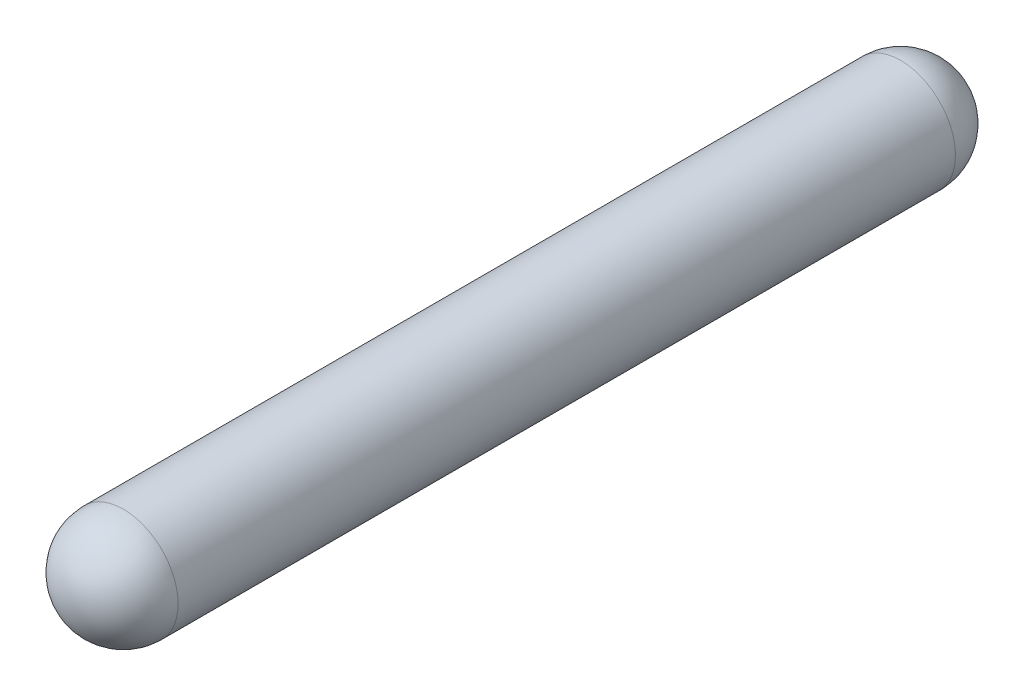
ISO-10303-21;
HEADER;
FILE_DESCRIPTION(('STEP AP214'),'2;1');
FILE_NAME('part.step','',(''),(''),'','','');
FILE_SCHEMA(('AUTOMOTIVE_DESIGN { 1 0 10303 214 1 1 1 1 }'));
ENDSEC;
DATA;
#1=APPLICATION_CONTEXT('core data for automotive mechanical design processes');
#2=APPLICATION_PROTOCOL_DEFINITION('international standard','automotive_design',2000,#1);
#3=PRODUCT_CONTEXT('',#1,'mechanical');
#4=PRODUCT('Part','Part','',(#3));
#5=PRODUCT_RELATED_PRODUCT_CATEGORY('part','',(#4));
#6=PRODUCT_DEFINITION_FORMATION('','',#4);
#7=PRODUCT_DEFINITION_CONTEXT('part definition',#1,'design');
#8=PRODUCT_DEFINITION('design','',#6,#7);
#9=PRODUCT_DEFINITION_SHAPE('','',#8);
#10=(LENGTH_UNIT() NAMED_UNIT(*) SI_UNIT(.MILLI.,.METRE.));
#11=(NAMED_UNIT(*) PLANE_ANGLE_UNIT() SI_UNIT($,.RADIAN.));
#12=(NAMED_UNIT(*) SI_UNIT($,.STERADIAN.) SOLID_ANGLE_UNIT());
#13=UNCERTAINTY_MEASURE_WITH_UNIT(LENGTH_MEASURE(1.E-05),#10,'distance_accuracy_value','');
#14=(GEOMETRIC_REPRESENTATION_CONTEXT(3) GLOBAL_UNCERTAINTY_ASSIGNED_CONTEXT((#13)) GLOBAL_UNIT_ASSIGNED_CONTEXT((#10,
#11,#12)) REPRESENTATION_CONTEXT('',''));
#15=CARTESIAN_POINT('',(0.,0.,0.));
#16=DIRECTION('',(0.,0.,1.));
#17=DIRECTION('',(1.,0.,0.));
#18=AXIS2_PLACEMENT_3D('',#15,#16,#17);
#19=CARTESIAN_POINT('',(0.,2.54,-3.));
#20=DIRECTION('',(1.,0.,0.));
#21=DIRECTION('',(0.,-1.,0.));
#22=AXIS2_PLACEMENT_3D('',#19,#20,#21);
#23=SPHERICAL_SURFACE('',#22,0.458);
#24=CARTESIAN_POINT('',(0.,2.54,-3.));
#25=DIRECTION('',(0.,0.,1.));
#26=DIRECTION('',(1.,0.,0.));
#27=AXIS2_PLACEMENT_3D('',#24,#25,#26);
#28=CIRCLE('',#27,0.458);
#29=CARTESIAN_POINT('',(0.458,2.54,-3.));
#30=VERTEX_POINT('',#29);
#31=CARTESIAN_POINT('',(-0.458,2.54,-3.));
#32=VERTEX_POINT('',#31);
#33=EDGE_CURVE('E42',#30,#32,#28,.T.);
#34=ORIENTED_EDGE('',*,*,#33,.F.);
#35=CARTESIAN_POINT('',(0.,2.54,-3.));
#36=DIRECTION('',(0.,0.,1.));
#37=DIRECTION('',(1.,0.,0.));
#38=AXIS2_PLACEMENT_3D('',#35,#36,#37);
#39=CIRCLE('',#38,0.458);
#40=EDGE_CURVE('E26',#32,#30,#39,.T.);
#41=ORIENTED_EDGE('',*,*,#40,.F.);
#42=EDGE_LOOP('',(#34,#41));
#43=FACE_BOUND('',#42,.T.);
#44=ADVANCED_FACE('F17',(#43),#23,.T.);
#45=CARTESIAN_POINT('',(0.,2.54,3.5));
#46=DIRECTION('',(1.,0.,0.));
#47=DIRECTION('',(0.,1.,0.));
#48=AXIS2_PLACEMENT_3D('',#45,#46,#47);
#49=SPHERICAL_SURFACE('',#48,0.458);
#50=CARTESIAN_POINT('',(0.,2.54,3.5));
#51=DIRECTION('',(0.,0.,1.));
#52=DIRECTION('',(1.,0.,0.));
#53=AXIS2_PLACEMENT_3D('',#50,#51,#52);
#54=CIRCLE('',#53,0.458);
#55=CARTESIAN_POINT('',(0.458,2.54,3.5));
#56=VERTEX_POINT('',#55);
#57=CARTESIAN_POINT('',(-0.458,2.54,3.5));
#58=VERTEX_POINT('',#57);
#59=EDGE_CURVE('E11',#56,#58,#54,.F.);
#60=ORIENTED_EDGE('',*,*,#59,.F.);
#61=CARTESIAN_POINT('',(0.,2.54,3.5));
#62=DIRECTION('',(0.,0.,1.));
#63=DIRECTION('',(1.,0.,0.));
#64=AXIS2_PLACEMENT_3D('',#61,#62,#63);
#65=CIRCLE('',#64,0.458);
#66=EDGE_CURVE('E34',#58,#56,#65,.F.);
#67=ORIENTED_EDGE('',*,*,#66,.F.);
#68=EDGE_LOOP('',(#60,#67));
#69=FACE_BOUND('',#68,.T.);
#70=ADVANCED_FACE('F49',(#69),#49,.T.);
#71=CARTESIAN_POINT('',(0.,2.54,-3.));
#72=DIRECTION('',(0.,0.,1.));
#73=DIRECTION('',(1.,0.,0.));
#74=AXIS2_PLACEMENT_3D('',#71,#72,#73);
#75=CYLINDRICAL_SURFACE('',#74,0.458);
#76=ORIENTED_EDGE('',*,*,#66,.T.);
#77=ORIENTED_EDGE('',*,*,#59,.T.);
#78=EDGE_LOOP('',(#76,#77));
#79=FACE_BOUND('',#78,.T.);
#80=ORIENTED_EDGE('',*,*,#40,.T.);
#81=ORIENTED_EDGE('',*,*,#33,.T.);
#82=EDGE_LOOP('',(#80,#81));
#83=FACE_BOUND('',#82,.T.);
#84=ADVANCED_FACE('F45',(#79,#83),#75,.T.);
#85=CLOSED_SHELL('',(#44,#70,#84));
#86=MANIFOLD_SOLID_BREP('B1',#85);
#87=ADVANCED_BREP_SHAPE_REPRESENTATION('',(#18,#86),#14);
#88=SHAPE_DEFINITION_REPRESENTATION(#9,#87);
ENDSEC;
END-ISO-10303-21;
